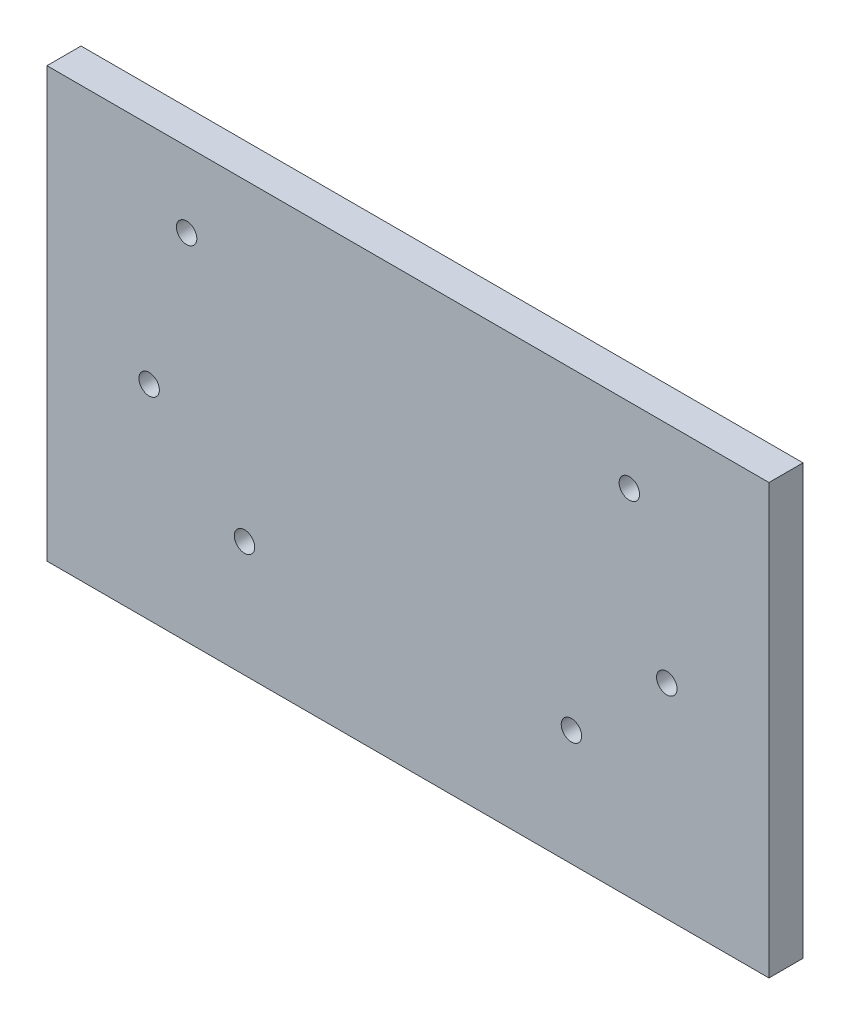
ISO-10303-21;
HEADER;
FILE_DESCRIPTION(('STEP AP214'),'2;1');
FILE_NAME('part.step','',(''),(''),'','','');
FILE_SCHEMA(('AUTOMOTIVE_DESIGN { 1 0 10303 214 1 1 1 1 }'));
ENDSEC;
DATA;
#1=APPLICATION_CONTEXT('core data for automotive mechanical design processes');
#2=APPLICATION_PROTOCOL_DEFINITION('international standard','automotive_design',2000,#1);
#3=PRODUCT_CONTEXT('',#1,'mechanical');
#4=PRODUCT('Part','Part','',(#3));
#5=PRODUCT_RELATED_PRODUCT_CATEGORY('part','',(#4));
#6=PRODUCT_DEFINITION_FORMATION('','',#4);
#7=PRODUCT_DEFINITION_CONTEXT('part definition',#1,'design');
#8=PRODUCT_DEFINITION('design','',#6,#7);
#9=PRODUCT_DEFINITION_SHAPE('','',#8);
#10=(LENGTH_UNIT() NAMED_UNIT(*) SI_UNIT(.MILLI.,.METRE.));
#11=(NAMED_UNIT(*) PLANE_ANGLE_UNIT() SI_UNIT($,.RADIAN.));
#12=(NAMED_UNIT(*) SI_UNIT($,.STERADIAN.) SOLID_ANGLE_UNIT());
#13=UNCERTAINTY_MEASURE_WITH_UNIT(LENGTH_MEASURE(1.E-05),#10,'distance_accuracy_value','');
#14=(GEOMETRIC_REPRESENTATION_CONTEXT(3) GLOBAL_UNCERTAINTY_ASSIGNED_CONTEXT((#13)) GLOBAL_UNIT_ASSIGNED_CONTEXT((#10,
#11,#12)) REPRESENTATION_CONTEXT('',''));
#15=CARTESIAN_POINT('',(0.,0.,0.));
#16=DIRECTION('',(0.,0.,1.));
#17=DIRECTION('',(1.,0.,0.));
#18=AXIS2_PLACEMENT_3D('',#15,#16,#17);
#19=CARTESIAN_POINT('',(53.,31.5,5.));
#20=DIRECTION('',(-1.,0.,0.));
#21=DIRECTION('',(0.,-1.,0.));
#22=AXIS2_PLACEMENT_3D('',#19,#20,#21);
#23=PLANE('',#22);
#24=DIRECTION('',(0.,1.,0.));
#25=VECTOR('',#24,1.);
#26=CARTESIAN_POINT('',(53.,31.5,0.));
#27=LINE('',#26,#25);
#28=CARTESIAN_POINT('',(53.,-31.5,0.));
#29=VERTEX_POINT('',#28);
#30=CARTESIAN_POINT('',(53.,31.5,0.));
#31=VERTEX_POINT('',#30);
#32=EDGE_CURVE('E96',#29,#31,#27,.T.);
#33=ORIENTED_EDGE('',*,*,#32,.T.);
#34=DIRECTION('',(0.,0.,-1.));
#35=VECTOR('',#34,1.);
#36=CARTESIAN_POINT('',(53.,31.5,5.));
#37=LINE('',#36,#35);
#38=CARTESIAN_POINT('',(53.,31.5,5.));
#39=VERTEX_POINT('',#38);
#40=EDGE_CURVE('E11',#39,#31,#37,.T.);
#41=ORIENTED_EDGE('',*,*,#40,.F.);
#42=DIRECTION('',(0.,1.,0.));
#43=VECTOR('',#42,1.);
#44=CARTESIAN_POINT('',(53.,31.5,5.));
#45=LINE('',#44,#43);
#46=CARTESIAN_POINT('',(53.,-31.5,5.));
#47=VERTEX_POINT('',#46);
#48=EDGE_CURVE('E84',#47,#39,#45,.T.);
#49=ORIENTED_EDGE('',*,*,#48,.F.);
#50=DIRECTION('',(0.,0.,-1.));
#51=VECTOR('',#50,1.);
#52=CARTESIAN_POINT('',(53.,-31.5,5.));
#53=LINE('',#52,#51);
#54=EDGE_CURVE('E92',#47,#29,#53,.T.);
#55=ORIENTED_EDGE('',*,*,#54,.T.);
#56=EDGE_LOOP('',(#33,#41,#49,#55));
#57=FACE_BOUND('',#56,.T.);
#58=ADVANCED_FACE('F33',(#57),#23,.F.);
#59=CARTESIAN_POINT('',(-53.,31.5,5.));
#60=DIRECTION('',(0.,-1.,0.));
#61=DIRECTION('',(0.,0.,-1.));
#62=AXIS2_PLACEMENT_3D('',#59,#60,#61);
#63=PLANE('',#62);
#64=DIRECTION('',(-1.,0.,0.));
#65=VECTOR('',#64,1.);
#66=CARTESIAN_POINT('',(-53.,31.5,0.));
#67=LINE('',#66,#65);
#68=CARTESIAN_POINT('',(-53.,31.5,0.));
#69=VERTEX_POINT('',#68);
#70=EDGE_CURVE('E88',#31,#69,#67,.T.);
#71=ORIENTED_EDGE('',*,*,#70,.T.);
#72=DIRECTION('',(0.,0.,-1.));
#73=VECTOR('',#72,1.);
#74=CARTESIAN_POINT('',(-53.,31.5,5.));
#75=LINE('',#74,#73);
#76=CARTESIAN_POINT('',(-53.,31.5,5.));
#77=VERTEX_POINT('',#76);
#78=EDGE_CURVE('E41',#77,#69,#75,.T.);
#79=ORIENTED_EDGE('',*,*,#78,.F.);
#80=DIRECTION('',(-1.,0.,0.));
#81=VECTOR('',#80,1.);
#82=CARTESIAN_POINT('',(-53.,31.5,5.));
#83=LINE('',#82,#81);
#84=EDGE_CURVE('E79',#39,#77,#83,.T.);
#85=ORIENTED_EDGE('',*,*,#84,.F.);
#86=ORIENTED_EDGE('',*,*,#40,.T.);
#87=EDGE_LOOP('',(#71,#79,#85,#86));
#88=FACE_BOUND('',#87,.T.);
#89=ADVANCED_FACE('F87',(#88),#63,.F.);
#90=CARTESIAN_POINT('',(-53.,31.5,5.));
#91=DIRECTION('',(1.,0.,0.));
#92=DIRECTION('',(0.,1.,0.));
#93=AXIS2_PLACEMENT_3D('',#90,#91,#92);
#94=PLANE('',#93);
#95=DIRECTION('',(0.,-1.,0.));
#96=VECTOR('',#95,1.);
#97=CARTESIAN_POINT('',(-53.,31.5,0.));
#98=LINE('',#97,#96);
#99=CARTESIAN_POINT('',(-53.,-31.5,0.));
#100=VERTEX_POINT('',#99);
#101=EDGE_CURVE('E66',#69,#100,#98,.T.);
#102=ORIENTED_EDGE('',*,*,#101,.T.);
#103=DIRECTION('',(0.,0.,-1.));
#104=VECTOR('',#103,1.);
#105=CARTESIAN_POINT('',(-53.,-31.5,5.));
#106=LINE('',#105,#104);
#107=CARTESIAN_POINT('',(-53.,-31.5,5.));
#108=VERTEX_POINT('',#107);
#109=EDGE_CURVE('E89',#108,#100,#106,.T.);
#110=ORIENTED_EDGE('',*,*,#109,.F.);
#111=DIRECTION('',(0.,-1.,0.));
#112=VECTOR('',#111,1.);
#113=CARTESIAN_POINT('',(-53.,31.5,5.));
#114=LINE('',#113,#112);
#115=EDGE_CURVE('E82',#77,#108,#114,.T.);
#116=ORIENTED_EDGE('',*,*,#115,.F.);
#117=ORIENTED_EDGE('',*,*,#78,.T.);
#118=EDGE_LOOP('',(#102,#110,#116,#117));
#119=FACE_BOUND('',#118,.T.);
#120=ADVANCED_FACE('F90',(#119),#94,.F.);
#121=CARTESIAN_POINT('',(-53.,-31.5,5.));
#122=DIRECTION('',(0.,1.,0.));
#123=DIRECTION('',(0.,0.,1.));
#124=AXIS2_PLACEMENT_3D('',#121,#122,#123);
#125=PLANE('',#124);
#126=DIRECTION('',(1.,0.,0.));
#127=VECTOR('',#126,1.);
#128=CARTESIAN_POINT('',(-53.,-31.5,0.));
#129=LINE('',#128,#127);
#130=EDGE_CURVE('E72',#100,#29,#129,.T.);
#131=ORIENTED_EDGE('',*,*,#130,.T.);
#132=ORIENTED_EDGE('',*,*,#54,.F.);
#133=DIRECTION('',(1.,0.,0.));
#134=VECTOR('',#133,1.);
#135=CARTESIAN_POINT('',(-53.,-31.5,5.));
#136=LINE('',#135,#134);
#137=EDGE_CURVE('E49',#108,#47,#136,.T.);
#138=ORIENTED_EDGE('',*,*,#137,.F.);
#139=ORIENTED_EDGE('',*,*,#109,.T.);
#140=EDGE_LOOP('',(#131,#132,#138,#139));
#141=FACE_BOUND('',#140,.T.);
#142=ADVANCED_FACE('F104',(#141),#125,.F.);
#143=CARTESIAN_POINT('',(0.,0.,5.));
#144=DIRECTION('',(0.,0.,1.));
#145=DIRECTION('',(1.,0.,0.));
#146=AXIS2_PLACEMENT_3D('',#143,#144,#145);
#147=PLANE('',#146);
#148=CARTESIAN_POINT('',(-32.5,20.5,5.));
#149=DIRECTION('',(0.,0.,1.));
#150=DIRECTION('',(1.,0.,0.));
#151=AXIS2_PLACEMENT_3D('',#148,#149,#150);
#152=CIRCLE('',#151,1.5);
#153=CARTESIAN_POINT('',(-31.,20.5,5.));
#154=VERTEX_POINT('',#153);
#155=EDGE_CURVE('E131',#154,#154,#152,.T.);
#156=ORIENTED_EDGE('',*,*,#155,.F.);
#157=EDGE_LOOP('',(#156));
#158=FACE_BOUND('',#157,.T.);
#159=CARTESIAN_POINT('',(38.,-1.5,5.));
#160=DIRECTION('',(0.,0.,1.));
#161=DIRECTION('',(1.,0.,0.));
#162=AXIS2_PLACEMENT_3D('',#159,#160,#161);
#163=CIRCLE('',#162,1.5);
#164=CARTESIAN_POINT('',(39.5,-1.5,5.));
#165=VERTEX_POINT('',#164);
#166=EDGE_CURVE('E120',#165,#165,#163,.T.);
#167=ORIENTED_EDGE('',*,*,#166,.F.);
#168=EDGE_LOOP('',(#167));
#169=FACE_BOUND('',#168,.T.);
#170=CARTESIAN_POINT('',(-38.,-1.5,5.));
#171=DIRECTION('',(0.,0.,1.));
#172=DIRECTION('',(1.,0.,0.));
#173=AXIS2_PLACEMENT_3D('',#170,#171,#172);
#174=CIRCLE('',#173,1.5);
#175=CARTESIAN_POINT('',(-36.5,-1.5,5.));
#176=VERTEX_POINT('',#175);
#177=EDGE_CURVE('E119',#176,#176,#174,.T.);
#178=ORIENTED_EDGE('',*,*,#177,.F.);
#179=EDGE_LOOP('',(#178));
#180=FACE_BOUND('',#179,.T.);
#181=CARTESIAN_POINT('',(24.,-14.5,5.));
#182=DIRECTION('',(0.,0.,1.));
#183=DIRECTION('',(1.,0.,0.));
#184=AXIS2_PLACEMENT_3D('',#181,#182,#183);
#185=CIRCLE('',#184,1.5);
#186=CARTESIAN_POINT('',(25.5,-14.5,5.));
#187=VERTEX_POINT('',#186);
#188=EDGE_CURVE('E113',#187,#187,#185,.T.);
#189=ORIENTED_EDGE('',*,*,#188,.F.);
#190=EDGE_LOOP('',(#189));
#191=FACE_BOUND('',#190,.T.);
#192=CARTESIAN_POINT('',(32.5,20.5,5.));
#193=DIRECTION('',(0.,0.,1.));
#194=DIRECTION('',(1.,0.,0.));
#195=AXIS2_PLACEMENT_3D('',#192,#193,#194);
#196=CIRCLE('',#195,1.5);
#197=CARTESIAN_POINT('',(34.,20.5,5.));
#198=VERTEX_POINT('',#197);
#199=EDGE_CURVE('E132',#198,#198,#196,.T.);
#200=ORIENTED_EDGE('',*,*,#199,.F.);
#201=EDGE_LOOP('',(#200));
#202=FACE_BOUND('',#201,.T.);
#203=CARTESIAN_POINT('',(-24.,-14.5,5.));
#204=DIRECTION('',(0.,0.,1.));
#205=DIRECTION('',(1.,0.,0.));
#206=AXIS2_PLACEMENT_3D('',#203,#204,#205);
#207=CIRCLE('',#206,1.5);
#208=CARTESIAN_POINT('',(-22.5,-14.5,5.));
#209=VERTEX_POINT('',#208);
#210=EDGE_CURVE('E99',#209,#209,#207,.T.);
#211=ORIENTED_EDGE('',*,*,#210,.F.);
#212=EDGE_LOOP('',(#211));
#213=FACE_BOUND('',#212,.T.);
#214=ORIENTED_EDGE('',*,*,#48,.T.);
#215=ORIENTED_EDGE('',*,*,#84,.T.);
#216=ORIENTED_EDGE('',*,*,#115,.T.);
#217=ORIENTED_EDGE('',*,*,#137,.T.);
#218=EDGE_LOOP('',(#214,#215,#216,#217));
#219=FACE_BOUND('',#218,.T.);
#220=ADVANCED_FACE('F80',(#158,#169,#180,#191,#202,#213,#219),#147,.T.);
#221=CARTESIAN_POINT('',(0.,0.,0.));
#222=DIRECTION('',(0.,0.,1.));
#223=DIRECTION('',(1.,0.,0.));
#224=AXIS2_PLACEMENT_3D('',#221,#222,#223);
#225=PLANE('',#224);
#226=CARTESIAN_POINT('',(-32.5,20.5,0.));
#227=DIRECTION('',(0.,0.,1.));
#228=DIRECTION('',(1.,0.,0.));
#229=AXIS2_PLACEMENT_3D('',#226,#227,#228);
#230=CIRCLE('',#229,1.5);
#231=CARTESIAN_POINT('',(-31.,20.5,0.));
#232=VERTEX_POINT('',#231);
#233=EDGE_CURVE('E128',#232,#232,#230,.T.);
#234=ORIENTED_EDGE('',*,*,#233,.T.);
#235=EDGE_LOOP('',(#234));
#236=FACE_BOUND('',#235,.T.);
#237=CARTESIAN_POINT('',(38.,-1.5,0.));
#238=DIRECTION('',(0.,0.,1.));
#239=DIRECTION('',(1.,0.,0.));
#240=AXIS2_PLACEMENT_3D('',#237,#238,#239);
#241=CIRCLE('',#240,1.5);
#242=CARTESIAN_POINT('',(39.5,-1.5,0.));
#243=VERTEX_POINT('',#242);
#244=EDGE_CURVE('E135',#243,#243,#241,.T.);
#245=ORIENTED_EDGE('',*,*,#244,.T.);
#246=EDGE_LOOP('',(#245));
#247=FACE_BOUND('',#246,.T.);
#248=CARTESIAN_POINT('',(-38.,-1.5,0.));
#249=DIRECTION('',(0.,0.,1.));
#250=DIRECTION('',(1.,0.,0.));
#251=AXIS2_PLACEMENT_3D('',#248,#249,#250);
#252=CIRCLE('',#251,1.5);
#253=CARTESIAN_POINT('',(-36.5,-1.5,0.));
#254=VERTEX_POINT('',#253);
#255=EDGE_CURVE('E116',#254,#254,#252,.T.);
#256=ORIENTED_EDGE('',*,*,#255,.T.);
#257=EDGE_LOOP('',(#256));
#258=FACE_BOUND('',#257,.T.);
#259=CARTESIAN_POINT('',(24.,-14.5,0.));
#260=DIRECTION('',(0.,0.,1.));
#261=DIRECTION('',(1.,0.,0.));
#262=AXIS2_PLACEMENT_3D('',#259,#260,#261);
#263=CIRCLE('',#262,1.5);
#264=CARTESIAN_POINT('',(25.5,-14.5,0.));
#265=VERTEX_POINT('',#264);
#266=EDGE_CURVE('E123',#265,#265,#263,.T.);
#267=ORIENTED_EDGE('',*,*,#266,.T.);
#268=EDGE_LOOP('',(#267));
#269=FACE_BOUND('',#268,.T.);
#270=CARTESIAN_POINT('',(32.5,20.5,0.));
#271=DIRECTION('',(0.,0.,1.));
#272=DIRECTION('',(1.,0.,0.));
#273=AXIS2_PLACEMENT_3D('',#270,#271,#272);
#274=CIRCLE('',#273,1.5);
#275=CARTESIAN_POINT('',(34.,20.5,0.));
#276=VERTEX_POINT('',#275);
#277=EDGE_CURVE('E140',#276,#276,#274,.T.);
#278=ORIENTED_EDGE('',*,*,#277,.T.);
#279=EDGE_LOOP('',(#278));
#280=FACE_BOUND('',#279,.T.);
#281=CARTESIAN_POINT('',(-24.,-14.5,0.));
#282=DIRECTION('',(0.,0.,1.));
#283=DIRECTION('',(1.,0.,0.));
#284=AXIS2_PLACEMENT_3D('',#281,#282,#283);
#285=CIRCLE('',#284,1.5);
#286=CARTESIAN_POINT('',(-22.5,-14.5,0.));
#287=VERTEX_POINT('',#286);
#288=EDGE_CURVE('E110',#287,#287,#285,.T.);
#289=ORIENTED_EDGE('',*,*,#288,.T.);
#290=EDGE_LOOP('',(#289));
#291=FACE_BOUND('',#290,.T.);
#292=ORIENTED_EDGE('',*,*,#32,.F.);
#293=ORIENTED_EDGE('',*,*,#130,.F.);
#294=ORIENTED_EDGE('',*,*,#101,.F.);
#295=ORIENTED_EDGE('',*,*,#70,.F.);
#296=EDGE_LOOP('',(#292,#293,#294,#295));
#297=FACE_BOUND('',#296,.T.);
#298=ADVANCED_FACE('F107',(#236,#247,#258,#269,#280,#291,#297),#225,.F.);
#299=CARTESIAN_POINT('',(-24.,-14.5,5.));
#300=DIRECTION('',(0.,0.,-1.));
#301=DIRECTION('',(-1.,0.,0.));
#302=AXIS2_PLACEMENT_3D('',#299,#300,#301);
#303=CYLINDRICAL_SURFACE('',#302,1.5);
#304=ORIENTED_EDGE('',*,*,#210,.T.);
#305=EDGE_LOOP('',(#304));
#306=FACE_BOUND('',#305,.T.);
#307=ORIENTED_EDGE('',*,*,#288,.F.);
#308=EDGE_LOOP('',(#307));
#309=FACE_BOUND('',#308,.T.);
#310=ADVANCED_FACE('F155',(#306,#309),#303,.F.);
#311=CARTESIAN_POINT('',(32.5,20.5,5.));
#312=DIRECTION('',(0.,0.,-1.));
#313=DIRECTION('',(-1.,0.,0.));
#314=AXIS2_PLACEMENT_3D('',#311,#312,#313);
#315=CYLINDRICAL_SURFACE('',#314,1.5);
#316=ORIENTED_EDGE('',*,*,#199,.T.);
#317=EDGE_LOOP('',(#316));
#318=FACE_BOUND('',#317,.T.);
#319=ORIENTED_EDGE('',*,*,#277,.F.);
#320=EDGE_LOOP('',(#319));
#321=FACE_BOUND('',#320,.T.);
#322=ADVANCED_FACE('F146',(#318,#321),#315,.F.);
#323=CARTESIAN_POINT('',(24.,-14.5,5.));
#324=DIRECTION('',(0.,0.,-1.));
#325=DIRECTION('',(-1.,0.,0.));
#326=AXIS2_PLACEMENT_3D('',#323,#324,#325);
#327=CYLINDRICAL_SURFACE('',#326,1.5);
#328=ORIENTED_EDGE('',*,*,#188,.T.);
#329=EDGE_LOOP('',(#328));
#330=FACE_BOUND('',#329,.T.);
#331=ORIENTED_EDGE('',*,*,#266,.F.);
#332=EDGE_LOOP('',(#331));
#333=FACE_BOUND('',#332,.T.);
#334=ADVANCED_FACE('F204',(#330,#333),#327,.F.);
#335=CARTESIAN_POINT('',(-38.,-1.5,5.));
#336=DIRECTION('',(0.,0.,-1.));
#337=DIRECTION('',(-1.,0.,0.));
#338=AXIS2_PLACEMENT_3D('',#335,#336,#337);
#339=CYLINDRICAL_SURFACE('',#338,1.5);
#340=ORIENTED_EDGE('',*,*,#177,.T.);
#341=EDGE_LOOP('',(#340));
#342=FACE_BOUND('',#341,.T.);
#343=ORIENTED_EDGE('',*,*,#255,.F.);
#344=EDGE_LOOP('',(#343));
#345=FACE_BOUND('',#344,.T.);
#346=ADVANCED_FACE('F213',(#342,#345),#339,.F.);
#347=CARTESIAN_POINT('',(38.,-1.5,5.));
#348=DIRECTION('',(0.,0.,-1.));
#349=DIRECTION('',(-1.,0.,0.));
#350=AXIS2_PLACEMENT_3D('',#347,#348,#349);
#351=CYLINDRICAL_SURFACE('',#350,1.5);
#352=ORIENTED_EDGE('',*,*,#166,.T.);
#353=EDGE_LOOP('',(#352));
#354=FACE_BOUND('',#353,.T.);
#355=ORIENTED_EDGE('',*,*,#244,.F.);
#356=EDGE_LOOP('',(#355));
#357=FACE_BOUND('',#356,.T.);
#358=ADVANCED_FACE('F223',(#354,#357),#351,.F.);
#359=CARTESIAN_POINT('',(-32.5,20.5,5.));
#360=DIRECTION('',(0.,0.,-1.));
#361=DIRECTION('',(-1.,0.,0.));
#362=AXIS2_PLACEMENT_3D('',#359,#360,#361);
#363=CYLINDRICAL_SURFACE('',#362,1.5);
#364=ORIENTED_EDGE('',*,*,#155,.T.);
#365=EDGE_LOOP('',(#364));
#366=FACE_BOUND('',#365,.T.);
#367=ORIENTED_EDGE('',*,*,#233,.F.);
#368=EDGE_LOOP('',(#367));
#369=FACE_BOUND('',#368,.T.);
#370=ADVANCED_FACE('F233',(#366,#369),#363,.F.);
#371=CLOSED_SHELL('',(#58,#89,#120,#142,#220,#298,#310,#322,#334,#346,#358,#370));
#372=MANIFOLD_SOLID_BREP('B2',#371);
#373=ADVANCED_BREP_SHAPE_REPRESENTATION('',(#18,#372),#14);
#374=SHAPE_DEFINITION_REPRESENTATION(#9,#373);
ENDSEC;
END-ISO-10303-21;
